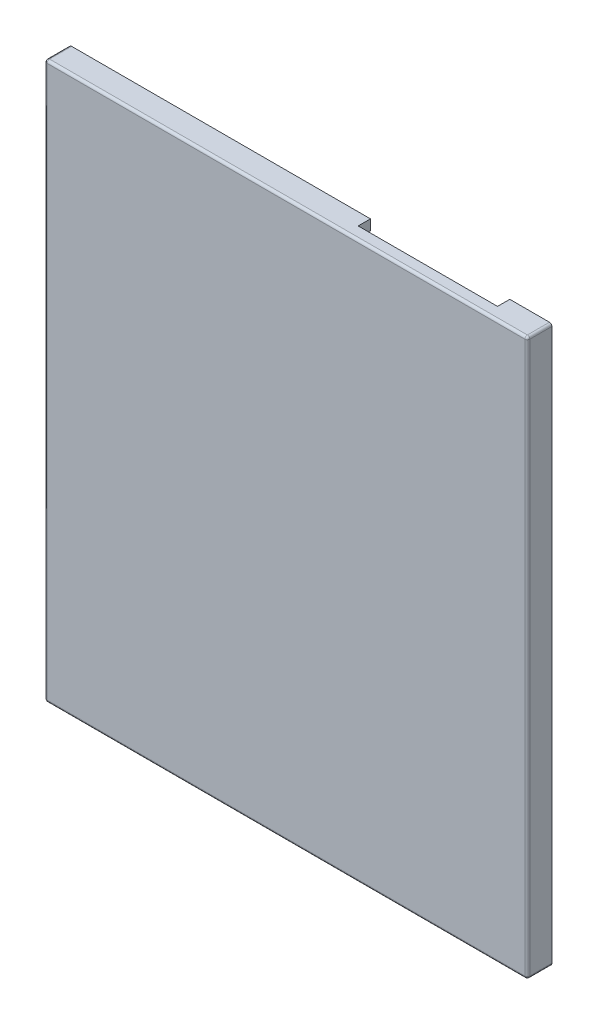
ISO-10303-21;
HEADER;
FILE_DESCRIPTION(('STEP AP214'),'2;1');
FILE_NAME('part.step','',(''),(''),'','','');
FILE_SCHEMA(('AUTOMOTIVE_DESIGN { 1 0 10303 214 1 1 1 1 }'));
ENDSEC;
DATA;
#1=APPLICATION_CONTEXT('core data for automotive mechanical design processes');
#2=APPLICATION_PROTOCOL_DEFINITION('international standard','automotive_design',2000,#1);
#3=PRODUCT_CONTEXT('',#1,'mechanical');
#4=PRODUCT('Part','Part','',(#3));
#5=PRODUCT_RELATED_PRODUCT_CATEGORY('part','',(#4));
#6=PRODUCT_DEFINITION_FORMATION('','',#4);
#7=PRODUCT_DEFINITION_CONTEXT('part definition',#1,'design');
#8=PRODUCT_DEFINITION('design','',#6,#7);
#9=PRODUCT_DEFINITION_SHAPE('','',#8);
#10=(LENGTH_UNIT() NAMED_UNIT(*) SI_UNIT(.MILLI.,.METRE.));
#11=(NAMED_UNIT(*) PLANE_ANGLE_UNIT() SI_UNIT($,.RADIAN.));
#12=(NAMED_UNIT(*) SI_UNIT($,.STERADIAN.) SOLID_ANGLE_UNIT());
#13=UNCERTAINTY_MEASURE_WITH_UNIT(LENGTH_MEASURE(1.E-05),#10,'distance_accuracy_value','');
#14=(GEOMETRIC_REPRESENTATION_CONTEXT(3) GLOBAL_UNCERTAINTY_ASSIGNED_CONTEXT((#13)) GLOBAL_UNIT_ASSIGNED_CONTEXT((#10,
#11,#12)) REPRESENTATION_CONTEXT('',''));
#15=CARTESIAN_POINT('',(0.,0.,0.));
#16=DIRECTION('',(0.,0.,1.));
#17=DIRECTION('',(1.,0.,0.));
#18=AXIS2_PLACEMENT_3D('',#15,#16,#17);
#19=CARTESIAN_POINT('',(-28.25,32.75,-1.5));
#20=DIRECTION('',(0.,1.,0.));
#21=DIRECTION('',(0.,0.,1.));
#22=AXIS2_PLACEMENT_3D('',#19,#20,#21);
#23=PLANE('',#22);
#24=DIRECTION('',(-1.,0.,0.));
#25=VECTOR('',#24,1.);
#26=CARTESIAN_POINT('',(-28.25,32.75,0.));
#27=LINE('',#26,#25);
#28=CARTESIAN_POINT('',(28.25,32.75,0.));
#29=VERTEX_POINT('',#28);
#30=CARTESIAN_POINT('',(24.3537366364064,32.75,0.));
#31=VERTEX_POINT('',#30);
#32=EDGE_CURVE('E254',#29,#31,#27,.T.);
#33=ORIENTED_EDGE('',*,*,#32,.T.);
#34=DIRECTION('',(0.,0.,-1.));
#35=VECTOR('',#34,1.);
#36=CARTESIAN_POINT('',(24.3537366364064,32.75,0.));
#37=LINE('',#36,#35);
#38=CARTESIAN_POINT('',(24.3537366364064,32.75,-1.5));
#39=VERTEX_POINT('',#38);
#40=EDGE_CURVE('E237',#31,#39,#37,.T.);
#41=ORIENTED_EDGE('',*,*,#40,.T.);
#42=DIRECTION('',(-1.,0.,0.));
#43=VECTOR('',#42,1.);
#44=CARTESIAN_POINT('',(-28.25,32.75,-1.5));
#45=LINE('',#44,#43);
#46=CARTESIAN_POINT('',(28.25,32.75,-1.5));
#47=VERTEX_POINT('',#46);
#48=EDGE_CURVE('E395',#47,#39,#45,.T.);
#49=ORIENTED_EDGE('',*,*,#48,.F.);
#50=DIRECTION('',(0.,0.,1.));
#51=VECTOR('',#50,1.);
#52=CARTESIAN_POINT('',(28.25,32.75,-1.5));
#53=LINE('',#52,#51);
#54=EDGE_CURVE('E264',#47,#29,#53,.T.);
#55=ORIENTED_EDGE('',*,*,#54,.T.);
#56=EDGE_LOOP('',(#33,#41,#49,#55));
#57=FACE_BOUND('',#56,.T.);
#58=ADVANCED_FACE('F38',(#57),#23,.F.);
#59=CARTESIAN_POINT('',(0.,0.,0.));
#60=DIRECTION('',(0.,0.,1.));
#61=DIRECTION('',(1.,0.,0.));
#62=AXIS2_PLACEMENT_3D('',#59,#60,#61);
#63=PLANE('',#62);
#64=DIRECTION('',(0.,1.,0.));
#65=VECTOR('',#64,1.);
#66=CARTESIAN_POINT('',(28.25,32.75,0.));
#67=LINE('',#66,#65);
#68=CARTESIAN_POINT('',(28.25,-32.75,0.));
#69=VERTEX_POINT('',#68);
#70=EDGE_CURVE('E274',#69,#29,#67,.T.);
#71=ORIENTED_EDGE('',*,*,#70,.F.);
#72=DIRECTION('',(1.,0.,0.));
#73=VECTOR('',#72,1.);
#74=CARTESIAN_POINT('',(-28.25,-32.75,0.));
#75=LINE('',#74,#73);
#76=CARTESIAN_POINT('',(-28.25,-32.75,0.));
#77=VERTEX_POINT('',#76);
#78=EDGE_CURVE('E272',#77,#69,#75,.T.);
#79=ORIENTED_EDGE('',*,*,#78,.F.);
#80=DIRECTION('',(0.,-1.,0.));
#81=VECTOR('',#80,1.);
#82=CARTESIAN_POINT('',(-28.25,32.75,0.));
#83=LINE('',#82,#81);
#84=CARTESIAN_POINT('',(-28.25,32.75,0.));
#85=VERTEX_POINT('',#84);
#86=EDGE_CURVE('E266',#85,#77,#83,.T.);
#87=ORIENTED_EDGE('',*,*,#86,.F.);
#88=CARTESIAN_POINT('',(7.31866225857841,32.75,0.));
#89=VERTEX_POINT('',#88);
#90=EDGE_CURVE('E267',#89,#85,#27,.T.);
#91=ORIENTED_EDGE('',*,*,#90,.F.);
#92=DIRECTION('',(0.,1.,0.));
#93=VECTOR('',#92,1.);
#94=CARTESIAN_POINT('',(7.31866225857841,32.75,0.));
#95=LINE('',#94,#93);
#96=CARTESIAN_POINT('',(7.31866225857841,34.,0.));
#97=VERTEX_POINT('',#96);
#98=EDGE_CURVE('E260',#89,#97,#95,.T.);
#99=ORIENTED_EDGE('',*,*,#98,.T.);
#100=DIRECTION('',(1.,0.,0.));
#101=VECTOR('',#100,1.);
#102=CARTESIAN_POINT('',(24.3537366364064,34.,0.));
#103=LINE('',#102,#101);
#104=CARTESIAN_POINT('',(24.3537366364064,34.,0.));
#105=VERTEX_POINT('',#104);
#106=EDGE_CURVE('E249',#97,#105,#103,.T.);
#107=ORIENTED_EDGE('',*,*,#106,.T.);
#108=DIRECTION('',(0.,-1.,0.));
#109=VECTOR('',#108,1.);
#110=CARTESIAN_POINT('',(24.3537366364064,32.75,0.));
#111=LINE('',#110,#109);
#112=EDGE_CURVE('E240',#105,#31,#111,.T.);
#113=ORIENTED_EDGE('',*,*,#112,.T.);
#114=ORIENTED_EDGE('',*,*,#32,.F.);
#115=EDGE_LOOP('',(#71,#79,#87,#91,#99,#107,#113,#114));
#116=FACE_BOUND('',#115,.T.);
#117=DIRECTION('',(-1.,0.,0.));
#118=VECTOR('',#117,1.);
#119=CARTESIAN_POINT('',(-1.25,-30.75,0.));
#120=LINE('',#119,#118);
#121=CARTESIAN_POINT('',(-1.25,-30.75,0.));
#122=VERTEX_POINT('',#121);
#123=CARTESIAN_POINT('',(-21.25,-30.75,0.));
#124=VERTEX_POINT('',#123);
#125=EDGE_CURVE('E571',#122,#124,#120,.T.);
#126=ORIENTED_EDGE('',*,*,#125,.F.);
#127=DIRECTION('',(0.,-1.,0.));
#128=VECTOR('',#127,1.);
#129=CARTESIAN_POINT('',(-1.25,-0.750000000000008,0.));
#130=LINE('',#129,#128);
#131=CARTESIAN_POINT('',(-1.25,-0.750000000000008,0.));
#132=VERTEX_POINT('',#131);
#133=EDGE_CURVE('E568',#132,#122,#130,.T.);
#134=ORIENTED_EDGE('',*,*,#133,.F.);
#135=DIRECTION('',(1.,0.,0.));
#136=VECTOR('',#135,1.);
#137=CARTESIAN_POINT('',(-1.25,-0.750000000000008,0.));
#138=LINE('',#137,#136);
#139=CARTESIAN_POINT('',(-21.25,-0.750000000000008,0.));
#140=VERTEX_POINT('',#139);
#141=EDGE_CURVE('E556',#140,#132,#138,.T.);
#142=ORIENTED_EDGE('',*,*,#141,.F.);
#143=DIRECTION('',(0.,1.,0.));
#144=VECTOR('',#143,1.);
#145=CARTESIAN_POINT('',(-21.25,-0.750000000000008,0.));
#146=LINE('',#145,#144);
#147=EDGE_CURVE('E575',#124,#140,#146,.T.);
#148=ORIENTED_EDGE('',*,*,#147,.F.);
#149=EDGE_LOOP('',(#126,#134,#142,#148));
#150=FACE_BOUND('',#149,.T.);
#151=DIRECTION('',(-1.,0.,0.));
#152=VECTOR('',#151,1.);
#153=CARTESIAN_POINT('',(4.75,11.25,0.));
#154=LINE('',#153,#152);
#155=CARTESIAN_POINT('',(4.75,11.25,0.));
#156=VERTEX_POINT('',#155);
#157=CARTESIAN_POINT('',(-20.25,11.25,0.));
#158=VERTEX_POINT('',#157);
#159=EDGE_CURVE('E486',#156,#158,#154,.T.);
#160=ORIENTED_EDGE('',*,*,#159,.F.);
#161=DIRECTION('',(0.,-1.,0.));
#162=VECTOR('',#161,1.);
#163=CARTESIAN_POINT('',(4.75,16.25,0.));
#164=LINE('',#163,#162);
#165=CARTESIAN_POINT('',(4.75,16.25,0.));
#166=VERTEX_POINT('',#165);
#167=EDGE_CURVE('E483',#166,#156,#164,.T.);
#168=ORIENTED_EDGE('',*,*,#167,.F.);
#169=DIRECTION('',(1.,0.,0.));
#170=VECTOR('',#169,1.);
#171=CARTESIAN_POINT('',(4.75,16.25,0.));
#172=LINE('',#171,#170);
#173=CARTESIAN_POINT('',(-20.25,16.25,0.));
#174=VERTEX_POINT('',#173);
#175=EDGE_CURVE('E470',#174,#166,#172,.T.);
#176=ORIENTED_EDGE('',*,*,#175,.F.);
#177=DIRECTION('',(0.,1.,0.));
#178=VECTOR('',#177,1.);
#179=CARTESIAN_POINT('',(-20.25,16.25,0.));
#180=LINE('',#179,#178);
#181=EDGE_CURVE('E491',#158,#174,#180,.T.);
#182=ORIENTED_EDGE('',*,*,#181,.F.);
#183=EDGE_LOOP('',(#160,#168,#176,#182));
#184=FACE_BOUND('',#183,.T.);
#185=DIRECTION('',(0.,-1.,0.));
#186=VECTOR('',#185,1.);
#187=CARTESIAN_POINT('',(9.44938671696299,9.74999999999999,0.));
#188=LINE('',#187,#186);
#189=CARTESIAN_POINT('',(9.44938671696299,9.74999999999999,0.));
#190=VERTEX_POINT('',#189);
#191=CARTESIAN_POINT('',(9.44938671696299,1.24999999999999,0.));
#192=VERTEX_POINT('',#191);
#193=EDGE_CURVE('E527',#190,#192,#188,.T.);
#194=ORIENTED_EDGE('',*,*,#193,.F.);
#195=DIRECTION('',(1.,0.,0.));
#196=VECTOR('',#195,1.);
#197=CARTESIAN_POINT('',(9.44938671696299,9.74999999999999,0.));
#198=LINE('',#197,#196);
#199=CARTESIAN_POINT('',(-21.25,9.74999999999999,0.));
#200=VERTEX_POINT('',#199);
#201=EDGE_CURVE('E514',#200,#190,#198,.T.);
#202=ORIENTED_EDGE('',*,*,#201,.F.);
#203=DIRECTION('',(0.,1.,0.));
#204=VECTOR('',#203,1.);
#205=CARTESIAN_POINT('',(-21.25,9.74999999999999,0.));
#206=LINE('',#205,#204);
#207=CARTESIAN_POINT('',(-21.25,1.24999999999999,0.));
#208=VERTEX_POINT('',#207);
#209=EDGE_CURVE('E64',#208,#200,#206,.T.);
#210=ORIENTED_EDGE('',*,*,#209,.F.);
#211=DIRECTION('',(-1.,0.,0.));
#212=VECTOR('',#211,1.);
#213=CARTESIAN_POINT('',(9.44938671696299,1.24999999999999,0.));
#214=LINE('',#213,#212);
#215=EDGE_CURVE('E531',#192,#208,#214,.T.);
#216=ORIENTED_EDGE('',*,*,#215,.F.);
#217=EDGE_LOOP('',(#194,#202,#210,#216));
#218=FACE_BOUND('',#217,.T.);
#219=ADVANCED_FACE('F252',(#116,#150,#184,#218),#63,.F.);
#220=CARTESIAN_POINT('',(0.,0.,1.5));
#221=DIRECTION('',(0.,0.,1.));
#222=DIRECTION('',(1.,0.,0.));
#223=AXIS2_PLACEMENT_3D('',#220,#221,#222);
#224=PLANE('',#223);
#225=DIRECTION('',(0.,-1.,0.));
#226=VECTOR('',#225,1.);
#227=CARTESIAN_POINT('',(-29.2,0.,1.5));
#228=LINE('',#227,#226);
#229=CARTESIAN_POINT('',(-29.2,33.7,1.5));
#230=VERTEX_POINT('',#229);
#231=CARTESIAN_POINT('',(-29.2,-33.7,1.5));
#232=VERTEX_POINT('',#231);
#233=EDGE_CURVE('E287',#230,#232,#228,.T.);
#234=ORIENTED_EDGE('',*,*,#233,.T.);
#235=DIRECTION('',(1.,0.,0.));
#236=VECTOR('',#235,1.);
#237=CARTESIAN_POINT('',(0.,-33.7,1.5));
#238=LINE('',#237,#236);
#239=CARTESIAN_POINT('',(29.2,-33.7,1.5));
#240=VERTEX_POINT('',#239);
#241=EDGE_CURVE('E290',#232,#240,#238,.T.);
#242=ORIENTED_EDGE('',*,*,#241,.T.);
#243=DIRECTION('',(0.,1.,0.));
#244=VECTOR('',#243,1.);
#245=CARTESIAN_POINT('',(29.2,0.,1.5));
#246=LINE('',#245,#244);
#247=CARTESIAN_POINT('',(29.2,33.7,1.5));
#248=VERTEX_POINT('',#247);
#249=EDGE_CURVE('E281',#240,#248,#246,.T.);
#250=ORIENTED_EDGE('',*,*,#249,.T.);
#251=DIRECTION('',(-1.,0.,0.));
#252=VECTOR('',#251,1.);
#253=CARTESIAN_POINT('',(0.,33.7,1.5));
#254=LINE('',#253,#252);
#255=EDGE_CURVE('E284',#248,#230,#254,.T.);
#256=ORIENTED_EDGE('',*,*,#255,.T.);
#257=EDGE_LOOP('',(#234,#242,#250,#256));
#258=FACE_BOUND('',#257,.T.);
#259=ADVANCED_FACE('F627',(#258),#224,.T.);
#260=CARTESIAN_POINT('',(28.25,32.75,-1.5));
#261=DIRECTION('',(1.,0.,0.));
#262=DIRECTION('',(0.,0.,-1.));
#263=AXIS2_PLACEMENT_3D('',#260,#261,#262);
#264=PLANE('',#263);
#265=DIRECTION('',(0.,0.,1.));
#266=VECTOR('',#265,1.);
#267=CARTESIAN_POINT('',(28.25,-32.75,-1.5));
#268=LINE('',#267,#266);
#269=CARTESIAN_POINT('',(28.25,-32.75,-1.5));
#270=VERTEX_POINT('',#269);
#271=EDGE_CURVE('E409',#270,#69,#268,.T.);
#272=ORIENTED_EDGE('',*,*,#271,.T.);
#273=ORIENTED_EDGE('',*,*,#70,.T.);
#274=ORIENTED_EDGE('',*,*,#54,.F.);
#275=DIRECTION('',(0.,1.,0.));
#276=VECTOR('',#275,1.);
#277=CARTESIAN_POINT('',(28.25,32.75,-1.5));
#278=LINE('',#277,#276);
#279=EDGE_CURVE('E385',#270,#47,#278,.T.);
#280=ORIENTED_EDGE('',*,*,#279,.F.);
#281=EDGE_LOOP('',(#272,#273,#274,#280));
#282=FACE_BOUND('',#281,.T.);
#283=ADVANCED_FACE('F443',(#282),#264,.F.);
#284=CARTESIAN_POINT('',(-28.25,-32.75,-1.5));
#285=DIRECTION('',(0.,-1.,0.));
#286=DIRECTION('',(0.,0.,-1.));
#287=AXIS2_PLACEMENT_3D('',#284,#285,#286);
#288=PLANE('',#287);
#289=DIRECTION('',(0.,0.,1.));
#290=VECTOR('',#289,1.);
#291=CARTESIAN_POINT('',(-28.25,-32.75,-1.5));
#292=LINE('',#291,#290);
#293=CARTESIAN_POINT('',(-28.25,-32.75,-1.5));
#294=VERTEX_POINT('',#293);
#295=EDGE_CURVE('E414',#294,#77,#292,.T.);
#296=ORIENTED_EDGE('',*,*,#295,.T.);
#297=ORIENTED_EDGE('',*,*,#78,.T.);
#298=ORIENTED_EDGE('',*,*,#271,.F.);
#299=DIRECTION('',(1.,0.,0.));
#300=VECTOR('',#299,1.);
#301=CARTESIAN_POINT('',(-28.25,-32.75,-1.5));
#302=LINE('',#301,#300);
#303=EDGE_CURVE('E406',#294,#270,#302,.T.);
#304=ORIENTED_EDGE('',*,*,#303,.F.);
#305=EDGE_LOOP('',(#296,#297,#298,#304));
#306=FACE_BOUND('',#305,.T.);
#307=ADVANCED_FACE('F446',(#306),#288,.F.);
#308=CARTESIAN_POINT('',(-28.25,32.75,-1.5));
#309=DIRECTION('',(-1.,0.,0.));
#310=DIRECTION('',(0.,0.,1.));
#311=AXIS2_PLACEMENT_3D('',#308,#309,#310);
#312=PLANE('',#311);
#313=DIRECTION('',(0.,0.,1.));
#314=VECTOR('',#313,1.);
#315=CARTESIAN_POINT('',(-28.25,32.75,-1.5));
#316=LINE('',#315,#314);
#317=CARTESIAN_POINT('',(-28.25,32.75,-1.5));
#318=VERTEX_POINT('',#317);
#319=EDGE_CURVE('E418',#318,#85,#316,.T.);
#320=ORIENTED_EDGE('',*,*,#319,.T.);
#321=ORIENTED_EDGE('',*,*,#86,.T.);
#322=ORIENTED_EDGE('',*,*,#295,.F.);
#323=DIRECTION('',(0.,-1.,0.));
#324=VECTOR('',#323,1.);
#325=CARTESIAN_POINT('',(-28.25,32.75,-1.5));
#326=LINE('',#325,#324);
#327=EDGE_CURVE('E402',#318,#294,#326,.T.);
#328=ORIENTED_EDGE('',*,*,#327,.F.);
#329=EDGE_LOOP('',(#320,#321,#322,#328));
#330=FACE_BOUND('',#329,.T.);
#331=ADVANCED_FACE('F450',(#330),#312,.F.);
#332=CARTESIAN_POINT('',(7.31866225857841,32.75,-1.5));
#333=VERTEX_POINT('',#332);
#334=EDGE_CURVE('E389',#333,#318,#45,.T.);
#335=ORIENTED_EDGE('',*,*,#334,.F.);
#336=DIRECTION('',(0.,0.,-1.));
#337=VECTOR('',#336,1.);
#338=CARTESIAN_POINT('',(7.31866225857841,32.75,0.));
#339=LINE('',#338,#337);
#340=EDGE_CURVE('E56',#89,#333,#339,.T.);
#341=ORIENTED_EDGE('',*,*,#340,.F.);
#342=ORIENTED_EDGE('',*,*,#90,.T.);
#343=ORIENTED_EDGE('',*,*,#319,.F.);
#344=EDGE_LOOP('',(#335,#341,#342,#343));
#345=FACE_BOUND('',#344,.T.);
#346=ADVANCED_FACE('F455',(#345),#23,.F.);
#347=CARTESIAN_POINT('',(29.5,34.,-1.5));
#348=DIRECTION('',(1.,0.,0.));
#349=DIRECTION('',(0.,1.,0.));
#350=AXIS2_PLACEMENT_3D('',#347,#348,#349);
#351=PLANE('',#350);
#352=DIRECTION('',(0.,1.,0.));
#353=VECTOR('',#352,1.);
#354=CARTESIAN_POINT('',(29.5,34.,1.2));
#355=LINE('',#354,#353);
#356=CARTESIAN_POINT('',(29.5,33.7,1.2));
#357=VERTEX_POINT('',#356);
#358=CARTESIAN_POINT('',(29.5,-33.7,1.2));
#359=VERTEX_POINT('',#358);
#360=EDGE_CURVE('E325',#357,#359,#355,.F.);
#361=ORIENTED_EDGE('',*,*,#360,.T.);
#362=DIRECTION('',(0.,0.,1.));
#363=VECTOR('',#362,1.);
#364=CARTESIAN_POINT('',(29.5,-33.7,-1.5));
#365=LINE('',#364,#363);
#366=CARTESIAN_POINT('',(29.5,-33.7,-1.5));
#367=VERTEX_POINT('',#366);
#368=EDGE_CURVE('E328',#359,#367,#365,.F.);
#369=ORIENTED_EDGE('',*,*,#368,.T.);
#370=DIRECTION('',(0.,1.,0.));
#371=VECTOR('',#370,1.);
#372=CARTESIAN_POINT('',(29.5,34.,-1.5));
#373=LINE('',#372,#371);
#374=CARTESIAN_POINT('',(29.5,33.7,-1.5));
#375=VERTEX_POINT('',#374);
#376=EDGE_CURVE('E413',#367,#375,#373,.T.);
#377=ORIENTED_EDGE('',*,*,#376,.T.);
#378=DIRECTION('',(0.,0.,1.));
#379=VECTOR('',#378,1.);
#380=CARTESIAN_POINT('',(29.5,33.7,-1.5));
#381=LINE('',#380,#379);
#382=EDGE_CURVE('E322',#375,#357,#381,.T.);
#383=ORIENTED_EDGE('',*,*,#382,.T.);
#384=EDGE_LOOP('',(#361,#369,#377,#383));
#385=FACE_BOUND('',#384,.T.);
#386=ADVANCED_FACE('F632',(#385),#351,.T.);
#387=CARTESIAN_POINT('',(-29.5,-34.,-1.5));
#388=DIRECTION('',(0.,-1.,0.));
#389=DIRECTION('',(0.,0.,-1.));
#390=AXIS2_PLACEMENT_3D('',#387,#388,#389);
#391=PLANE('',#390);
#392=DIRECTION('',(1.,0.,0.));
#393=VECTOR('',#392,1.);
#394=CARTESIAN_POINT('',(-29.5,-34.,1.2));
#395=LINE('',#394,#393);
#396=CARTESIAN_POINT('',(29.2,-34.,1.2));
#397=VERTEX_POINT('',#396);
#398=CARTESIAN_POINT('',(-29.2,-34.,1.2));
#399=VERTEX_POINT('',#398);
#400=EDGE_CURVE('E297',#397,#399,#395,.F.);
#401=ORIENTED_EDGE('',*,*,#400,.T.);
#402=DIRECTION('',(0.,0.,1.));
#403=VECTOR('',#402,1.);
#404=CARTESIAN_POINT('',(-29.2,-34.,-1.5));
#405=LINE('',#404,#403);
#406=CARTESIAN_POINT('',(-29.2,-34.,-1.5));
#407=VERTEX_POINT('',#406);
#408=EDGE_CURVE('E301',#399,#407,#405,.F.);
#409=ORIENTED_EDGE('',*,*,#408,.T.);
#410=DIRECTION('',(1.,0.,0.));
#411=VECTOR('',#410,1.);
#412=CARTESIAN_POINT('',(-29.5,-34.,-1.5));
#413=LINE('',#412,#411);
#414=CARTESIAN_POINT('',(29.2,-34.,-1.5));
#415=VERTEX_POINT('',#414);
#416=EDGE_CURVE('E435',#407,#415,#413,.T.);
#417=ORIENTED_EDGE('',*,*,#416,.T.);
#418=DIRECTION('',(0.,0.,1.));
#419=VECTOR('',#418,1.);
#420=CARTESIAN_POINT('',(29.2,-34.,-1.5));
#421=LINE('',#420,#419);
#422=EDGE_CURVE('E294',#415,#397,#421,.T.);
#423=ORIENTED_EDGE('',*,*,#422,.T.);
#424=EDGE_LOOP('',(#401,#409,#417,#423));
#425=FACE_BOUND('',#424,.T.);
#426=ADVANCED_FACE('F637',(#425),#391,.T.);
#427=CARTESIAN_POINT('',(-29.5,34.,-1.5));
#428=DIRECTION('',(-1.,0.,0.));
#429=DIRECTION('',(0.,-1.,0.));
#430=AXIS2_PLACEMENT_3D('',#427,#428,#429);
#431=PLANE('',#430);
#432=DIRECTION('',(0.,-1.,0.));
#433=VECTOR('',#432,1.);
#434=CARTESIAN_POINT('',(-29.5,34.,1.2));
#435=LINE('',#434,#433);
#436=CARTESIAN_POINT('',(-29.5,-33.7,1.2));
#437=VERTEX_POINT('',#436);
#438=CARTESIAN_POINT('',(-29.5,33.7,1.2));
#439=VERTEX_POINT('',#438);
#440=EDGE_CURVE('E307',#437,#439,#435,.F.);
#441=ORIENTED_EDGE('',*,*,#440,.T.);
#442=DIRECTION('',(0.,0.,1.));
#443=VECTOR('',#442,1.);
#444=CARTESIAN_POINT('',(-29.5,33.7,-1.5));
#445=LINE('',#444,#443);
#446=CARTESIAN_POINT('',(-29.5,33.7,-1.5));
#447=VERTEX_POINT('',#446);
#448=EDGE_CURVE('E310',#439,#447,#445,.F.);
#449=ORIENTED_EDGE('',*,*,#448,.T.);
#450=DIRECTION('',(0.,-1.,0.));
#451=VECTOR('',#450,1.);
#452=CARTESIAN_POINT('',(-29.5,34.,-1.5));
#453=LINE('',#452,#451);
#454=CARTESIAN_POINT('',(-29.5,-33.7,-1.5));
#455=VERTEX_POINT('',#454);
#456=EDGE_CURVE('E432',#447,#455,#453,.T.);
#457=ORIENTED_EDGE('',*,*,#456,.T.);
#458=DIRECTION('',(0.,0.,1.));
#459=VECTOR('',#458,1.);
#460=CARTESIAN_POINT('',(-29.5,-33.7,-1.5));
#461=LINE('',#460,#459);
#462=EDGE_CURVE('E304',#455,#437,#461,.T.);
#463=ORIENTED_EDGE('',*,*,#462,.T.);
#464=EDGE_LOOP('',(#441,#449,#457,#463));
#465=FACE_BOUND('',#464,.T.);
#466=ADVANCED_FACE('F658',(#465),#431,.T.);
#467=CARTESIAN_POINT('',(-29.5,34.,-1.5));
#468=DIRECTION('',(0.,1.,0.));
#469=DIRECTION('',(0.,0.,1.));
#470=AXIS2_PLACEMENT_3D('',#467,#468,#469);
#471=PLANE('',#470);
#472=DIRECTION('',(0.,0.,-1.));
#473=VECTOR('',#472,1.);
#474=CARTESIAN_POINT('',(24.3537366364064,34.,0.));
#475=LINE('',#474,#473);
#476=CARTESIAN_POINT('',(24.3537366364064,34.,-1.5));
#477=VERTEX_POINT('',#476);
#478=EDGE_CURVE('E461',#105,#477,#475,.T.);
#479=ORIENTED_EDGE('',*,*,#478,.F.);
#480=ORIENTED_EDGE('',*,*,#106,.F.);
#481=DIRECTION('',(0.,0.,-1.));
#482=VECTOR('',#481,1.);
#483=CARTESIAN_POINT('',(7.31866225857841,34.,0.));
#484=LINE('',#483,#482);
#485=CARTESIAN_POINT('',(7.31866225857841,34.,-1.5));
#486=VERTEX_POINT('',#485);
#487=EDGE_CURVE('E457',#97,#486,#484,.T.);
#488=ORIENTED_EDGE('',*,*,#487,.T.);
#489=DIRECTION('',(-1.,0.,0.));
#490=VECTOR('',#489,1.);
#491=CARTESIAN_POINT('',(-29.5,34.,-1.5));
#492=LINE('',#491,#490);
#493=CARTESIAN_POINT('',(-29.2,34.,-1.5));
#494=VERTEX_POINT('',#493);
#495=EDGE_CURVE('E427',#486,#494,#492,.T.);
#496=ORIENTED_EDGE('',*,*,#495,.T.);
#497=DIRECTION('',(0.,0.,1.));
#498=VECTOR('',#497,1.);
#499=CARTESIAN_POINT('',(-29.2,34.,-1.5));
#500=LINE('',#499,#498);
#501=CARTESIAN_POINT('',(-29.2,34.,1.2));
#502=VERTEX_POINT('',#501);
#503=EDGE_CURVE('E319',#494,#502,#500,.T.);
#504=ORIENTED_EDGE('',*,*,#503,.T.);
#505=DIRECTION('',(-1.,0.,0.));
#506=VECTOR('',#505,1.);
#507=CARTESIAN_POINT('',(-29.5,34.,1.2));
#508=LINE('',#507,#506);
#509=CARTESIAN_POINT('',(29.2,34.,1.2));
#510=VERTEX_POINT('',#509);
#511=EDGE_CURVE('E316',#502,#510,#508,.F.);
#512=ORIENTED_EDGE('',*,*,#511,.T.);
#513=DIRECTION('',(0.,0.,1.));
#514=VECTOR('',#513,1.);
#515=CARTESIAN_POINT('',(29.2,34.,-1.5));
#516=LINE('',#515,#514);
#517=CARTESIAN_POINT('',(29.2,34.,-1.5));
#518=VERTEX_POINT('',#517);
#519=EDGE_CURVE('E313',#510,#518,#516,.F.);
#520=ORIENTED_EDGE('',*,*,#519,.T.);
#521=EDGE_CURVE('E428',#518,#477,#492,.T.);
#522=ORIENTED_EDGE('',*,*,#521,.T.);
#523=EDGE_LOOP('',(#479,#480,#488,#496,#504,#512,#520,#522));
#524=FACE_BOUND('',#523,.T.);
#525=ADVANCED_FACE('F655',(#524),#471,.T.);
#526=CARTESIAN_POINT('',(0.,0.,-1.5));
#527=DIRECTION('',(0.,0.,1.));
#528=DIRECTION('',(1.,0.,0.));
#529=AXIS2_PLACEMENT_3D('',#526,#527,#528);
#530=PLANE('',#529);
#531=ORIENTED_EDGE('',*,*,#48,.T.);
#532=DIRECTION('',(0.,-1.,0.));
#533=VECTOR('',#532,1.);
#534=CARTESIAN_POINT('',(24.3537366364064,32.75,-1.5));
#535=LINE('',#534,#533);
#536=EDGE_CURVE('E243',#477,#39,#535,.T.);
#537=ORIENTED_EDGE('',*,*,#536,.F.);
#538=ORIENTED_EDGE('',*,*,#521,.F.);
#539=CARTESIAN_POINT('',(29.2,33.7,-1.5));
#540=DIRECTION('',(0.,0.,1.));
#541=DIRECTION('',(1.,0.,0.));
#542=AXIS2_PLACEMENT_3D('',#539,#540,#541);
#543=CIRCLE('',#542,0.3);
#544=EDGE_CURVE('E331',#518,#375,#543,.F.);
#545=ORIENTED_EDGE('',*,*,#544,.T.);
#546=ORIENTED_EDGE('',*,*,#376,.F.);
#547=CARTESIAN_POINT('',(29.2,-33.7,-1.5));
#548=DIRECTION('',(0.,0.,1.));
#549=DIRECTION('',(1.,0.,0.));
#550=AXIS2_PLACEMENT_3D('',#547,#548,#549);
#551=CIRCLE('',#550,0.3);
#552=EDGE_CURVE('E334',#367,#415,#551,.F.);
#553=ORIENTED_EDGE('',*,*,#552,.T.);
#554=ORIENTED_EDGE('',*,*,#416,.F.);
#555=CARTESIAN_POINT('',(-29.2,-33.7,-1.5));
#556=DIRECTION('',(0.,0.,1.));
#557=DIRECTION('',(1.,0.,0.));
#558=AXIS2_PLACEMENT_3D('',#555,#556,#557);
#559=CIRCLE('',#558,0.3);
#560=EDGE_CURVE('E48',#407,#455,#559,.F.);
#561=ORIENTED_EDGE('',*,*,#560,.T.);
#562=ORIENTED_EDGE('',*,*,#456,.F.);
#563=CARTESIAN_POINT('',(-29.2,33.7,-1.5));
#564=DIRECTION('',(0.,0.,1.));
#565=DIRECTION('',(1.,0.,0.));
#566=AXIS2_PLACEMENT_3D('',#563,#564,#565);
#567=CIRCLE('',#566,0.3);
#568=EDGE_CURVE('E11',#447,#494,#567,.F.);
#569=ORIENTED_EDGE('',*,*,#568,.T.);
#570=ORIENTED_EDGE('',*,*,#495,.F.);
#571=DIRECTION('',(0.,1.,0.));
#572=VECTOR('',#571,1.);
#573=CARTESIAN_POINT('',(7.31866225857841,32.75,-1.5));
#574=LINE('',#573,#572);
#575=EDGE_CURVE('E261',#333,#486,#574,.T.);
#576=ORIENTED_EDGE('',*,*,#575,.F.);
#577=ORIENTED_EDGE('',*,*,#334,.T.);
#578=ORIENTED_EDGE('',*,*,#327,.T.);
#579=ORIENTED_EDGE('',*,*,#303,.T.);
#580=ORIENTED_EDGE('',*,*,#279,.T.);
#581=EDGE_LOOP('',(#531,#537,#538,#545,#546,#553,#554,#561,#562,#569,#570,#576,#577,#578,#579,#580));
#582=FACE_BOUND('',#581,.T.);
#583=ADVANCED_FACE('F652',(#582),#530,.F.);
#584=CARTESIAN_POINT('',(-29.2,33.7,-1.5));
#585=DIRECTION('',(0.,0.,1.));
#586=DIRECTION('',(1.,0.,0.));
#587=AXIS2_PLACEMENT_3D('',#584,#585,#586);
#588=CYLINDRICAL_SURFACE('',#587,0.3);
#589=ORIENTED_EDGE('',*,*,#568,.F.);
#590=ORIENTED_EDGE('',*,*,#448,.F.);
#591=CARTESIAN_POINT('',(-29.2,33.7,1.2));
#592=DIRECTION('',(0.,0.,1.));
#593=DIRECTION('',(1.,0.,0.));
#594=AXIS2_PLACEMENT_3D('',#591,#592,#593);
#595=CIRCLE('',#594,0.3);
#596=EDGE_CURVE('E42',#502,#439,#595,.T.);
#597=ORIENTED_EDGE('',*,*,#596,.F.);
#598=ORIENTED_EDGE('',*,*,#503,.F.);
#599=EDGE_LOOP('',(#589,#590,#597,#598));
#600=FACE_BOUND('',#599,.T.);
#601=ADVANCED_FACE('F40',(#600),#588,.T.);
#602=CARTESIAN_POINT('',(0.,33.7,1.2));
#603=DIRECTION('',(-1.,0.,0.));
#604=DIRECTION('',(0.,0.,1.));
#605=AXIS2_PLACEMENT_3D('',#602,#603,#604);
#606=CYLINDRICAL_SURFACE('',#605,0.3);
#607=CARTESIAN_POINT('',(29.2,33.7,1.2));
#608=DIRECTION('',(1.,0.,0.));
#609=DIRECTION('',(0.,0.,-1.));
#610=AXIS2_PLACEMENT_3D('',#607,#608,#609);
#611=CIRCLE('',#610,0.3);
#612=EDGE_CURVE('E374',#510,#248,#611,.T.);
#613=ORIENTED_EDGE('',*,*,#612,.F.);
#614=ORIENTED_EDGE('',*,*,#511,.F.);
#615=CARTESIAN_POINT('',(-29.2,33.7,1.2));
#616=DIRECTION('',(-1.,0.,0.));
#617=DIRECTION('',(0.,0.,1.));
#618=AXIS2_PLACEMENT_3D('',#615,#616,#617);
#619=CIRCLE('',#618,0.3);
#620=EDGE_CURVE('E377',#230,#502,#619,.T.);
#621=ORIENTED_EDGE('',*,*,#620,.F.);
#622=ORIENTED_EDGE('',*,*,#255,.F.);
#623=EDGE_LOOP('',(#613,#614,#621,#622));
#624=FACE_BOUND('',#623,.T.);
#625=ADVANCED_FACE('F697',(#624),#606,.T.);
#626=CARTESIAN_POINT('',(29.2,33.7,-1.5));
#627=DIRECTION('',(0.,0.,1.));
#628=DIRECTION('',(1.,0.,0.));
#629=AXIS2_PLACEMENT_3D('',#626,#627,#628);
#630=CYLINDRICAL_SURFACE('',#629,0.3);
#631=ORIENTED_EDGE('',*,*,#544,.F.);
#632=ORIENTED_EDGE('',*,*,#519,.F.);
#633=CARTESIAN_POINT('',(29.2,33.7,1.2));
#634=DIRECTION('',(0.,0.,1.));
#635=DIRECTION('',(1.,0.,0.));
#636=AXIS2_PLACEMENT_3D('',#633,#634,#635);
#637=CIRCLE('',#636,0.3);
#638=EDGE_CURVE('E370',#357,#510,#637,.T.);
#639=ORIENTED_EDGE('',*,*,#638,.F.);
#640=ORIENTED_EDGE('',*,*,#382,.F.);
#641=EDGE_LOOP('',(#631,#632,#639,#640));
#642=FACE_BOUND('',#641,.T.);
#643=ADVANCED_FACE('F695',(#642),#630,.T.);
#644=CARTESIAN_POINT('',(-29.2,33.7,1.2));
#645=DIRECTION('',(0.,0.,1.));
#646=DIRECTION('',(1.,0.,0.));
#647=AXIS2_PLACEMENT_3D('',#644,#645,#646);
#648=SPHERICAL_SURFACE('',#647,0.3);
#649=ORIENTED_EDGE('',*,*,#620,.T.);
#650=ORIENTED_EDGE('',*,*,#596,.T.);
#651=CARTESIAN_POINT('',(-29.2,33.7,1.2));
#652=DIRECTION('',(0.,1.,0.));
#653=DIRECTION('',(0.,0.,1.));
#654=AXIS2_PLACEMENT_3D('',#651,#652,#653);
#655=CIRCLE('',#654,0.3);
#656=EDGE_CURVE('E366',#230,#439,#655,.F.);
#657=ORIENTED_EDGE('',*,*,#656,.F.);
#658=EDGE_LOOP('',(#649,#650,#657));
#659=FACE_BOUND('',#658,.T.);
#660=ADVANCED_FACE('F691',(#659),#648,.T.);
#661=CARTESIAN_POINT('',(29.2,33.7,1.2));
#662=DIRECTION('',(0.,0.,1.));
#663=DIRECTION('',(1.,0.,0.));
#664=AXIS2_PLACEMENT_3D('',#661,#662,#663);
#665=SPHERICAL_SURFACE('',#664,0.3);
#666=ORIENTED_EDGE('',*,*,#638,.T.);
#667=ORIENTED_EDGE('',*,*,#612,.T.);
#668=CARTESIAN_POINT('',(29.2,33.7,1.2));
#669=DIRECTION('',(0.,1.,0.));
#670=DIRECTION('',(0.,0.,1.));
#671=AXIS2_PLACEMENT_3D('',#668,#669,#670);
#672=CIRCLE('',#671,0.3);
#673=EDGE_CURVE('E362',#357,#248,#672,.F.);
#674=ORIENTED_EDGE('',*,*,#673,.F.);
#675=EDGE_LOOP('',(#666,#667,#674));
#676=FACE_BOUND('',#675,.T.);
#677=ADVANCED_FACE('F687',(#676),#665,.T.);
#678=CARTESIAN_POINT('',(-29.2,-33.7,-1.5));
#679=DIRECTION('',(0.,0.,1.));
#680=DIRECTION('',(1.,0.,0.));
#681=AXIS2_PLACEMENT_3D('',#678,#679,#680);
#682=CYLINDRICAL_SURFACE('',#681,0.3);
#683=ORIENTED_EDGE('',*,*,#560,.F.);
#684=ORIENTED_EDGE('',*,*,#408,.F.);
#685=CARTESIAN_POINT('',(-29.2,-33.7,1.2));
#686=DIRECTION('',(0.,0.,1.));
#687=DIRECTION('',(1.,0.,0.));
#688=AXIS2_PLACEMENT_3D('',#685,#686,#687);
#689=CIRCLE('',#688,0.3);
#690=EDGE_CURVE('E358',#437,#399,#689,.T.);
#691=ORIENTED_EDGE('',*,*,#690,.F.);
#692=ORIENTED_EDGE('',*,*,#462,.F.);
#693=EDGE_LOOP('',(#683,#684,#691,#692));
#694=FACE_BOUND('',#693,.T.);
#695=ADVANCED_FACE('F683',(#694),#682,.T.);
#696=CARTESIAN_POINT('',(-29.2,0.,1.2));
#697=DIRECTION('',(0.,-1.,0.));
#698=DIRECTION('',(1.,0.,0.));
#699=AXIS2_PLACEMENT_3D('',#696,#697,#698);
#700=CYLINDRICAL_SURFACE('',#699,0.3);
#701=ORIENTED_EDGE('',*,*,#656,.T.);
#702=ORIENTED_EDGE('',*,*,#440,.F.);
#703=CARTESIAN_POINT('',(-29.2,-33.7,1.2));
#704=DIRECTION('',(0.,-1.,0.));
#705=DIRECTION('',(1.,0.,0.));
#706=AXIS2_PLACEMENT_3D('',#703,#704,#705);
#707=CIRCLE('',#706,0.3);
#708=EDGE_CURVE('E354',#232,#437,#707,.T.);
#709=ORIENTED_EDGE('',*,*,#708,.F.);
#710=ORIENTED_EDGE('',*,*,#233,.F.);
#711=EDGE_LOOP('',(#701,#702,#709,#710));
#712=FACE_BOUND('',#711,.T.);
#713=ADVANCED_FACE('F679',(#712),#700,.T.);
#714=CARTESIAN_POINT('',(29.2,0.,1.2));
#715=DIRECTION('',(0.,1.,0.));
#716=DIRECTION('',(-1.,0.,0.));
#717=AXIS2_PLACEMENT_3D('',#714,#715,#716);
#718=CYLINDRICAL_SURFACE('',#717,0.3);
#719=ORIENTED_EDGE('',*,*,#673,.T.);
#720=ORIENTED_EDGE('',*,*,#249,.F.);
#721=CARTESIAN_POINT('',(29.2,-33.7,1.2));
#722=DIRECTION('',(0.,-1.,0.));
#723=DIRECTION('',(0.,0.,-1.));
#724=AXIS2_PLACEMENT_3D('',#721,#722,#723);
#725=CIRCLE('',#724,0.3);
#726=EDGE_CURVE('E350',#359,#240,#725,.T.);
#727=ORIENTED_EDGE('',*,*,#726,.F.);
#728=ORIENTED_EDGE('',*,*,#360,.F.);
#729=EDGE_LOOP('',(#719,#720,#727,#728));
#730=FACE_BOUND('',#729,.T.);
#731=ADVANCED_FACE('F675',(#730),#718,.T.);
#732=CARTESIAN_POINT('',(29.2,-33.7,-1.5));
#733=DIRECTION('',(0.,0.,1.));
#734=DIRECTION('',(1.,0.,0.));
#735=AXIS2_PLACEMENT_3D('',#732,#733,#734);
#736=CYLINDRICAL_SURFACE('',#735,0.3);
#737=ORIENTED_EDGE('',*,*,#552,.F.);
#738=ORIENTED_EDGE('',*,*,#368,.F.);
#739=CARTESIAN_POINT('',(29.2,-33.7,1.2));
#740=DIRECTION('',(0.,0.,1.));
#741=DIRECTION('',(1.,0.,0.));
#742=AXIS2_PLACEMENT_3D('',#739,#740,#741);
#743=CIRCLE('',#742,0.3);
#744=EDGE_CURVE('E346',#397,#359,#743,.T.);
#745=ORIENTED_EDGE('',*,*,#744,.F.);
#746=ORIENTED_EDGE('',*,*,#422,.F.);
#747=EDGE_LOOP('',(#737,#738,#745,#746));
#748=FACE_BOUND('',#747,.T.);
#749=ADVANCED_FACE('F671',(#748),#736,.T.);
#750=CARTESIAN_POINT('',(-29.2,-33.7,1.2));
#751=DIRECTION('',(0.,0.,1.));
#752=DIRECTION('',(1.,0.,0.));
#753=AXIS2_PLACEMENT_3D('',#750,#751,#752);
#754=SPHERICAL_SURFACE('',#753,0.3);
#755=ORIENTED_EDGE('',*,*,#708,.T.);
#756=ORIENTED_EDGE('',*,*,#690,.T.);
#757=CARTESIAN_POINT('',(-29.2,-33.7,1.2));
#758=DIRECTION('',(-1.,0.,0.));
#759=DIRECTION('',(0.,0.,1.));
#760=AXIS2_PLACEMENT_3D('',#757,#758,#759);
#761=CIRCLE('',#760,0.3);
#762=EDGE_CURVE('E342',#232,#399,#761,.F.);
#763=ORIENTED_EDGE('',*,*,#762,.F.);
#764=EDGE_LOOP('',(#755,#756,#763));
#765=FACE_BOUND('',#764,.T.);
#766=ADVANCED_FACE('F667',(#765),#754,.T.);
#767=CARTESIAN_POINT('',(29.2,-33.7,1.2));
#768=DIRECTION('',(0.,0.,1.));
#769=DIRECTION('',(1.,0.,0.));
#770=AXIS2_PLACEMENT_3D('',#767,#768,#769);
#771=SPHERICAL_SURFACE('',#770,0.3);
#772=ORIENTED_EDGE('',*,*,#744,.T.);
#773=ORIENTED_EDGE('',*,*,#726,.T.);
#774=CARTESIAN_POINT('',(29.2,-33.7,1.2));
#775=DIRECTION('',(1.,0.,0.));
#776=DIRECTION('',(0.,1.,0.));
#777=AXIS2_PLACEMENT_3D('',#774,#775,#776);
#778=CIRCLE('',#777,0.3);
#779=EDGE_CURVE('E339',#397,#240,#778,.F.);
#780=ORIENTED_EDGE('',*,*,#779,.F.);
#781=EDGE_LOOP('',(#772,#773,#780));
#782=FACE_BOUND('',#781,.T.);
#783=ADVANCED_FACE('F617',(#782),#771,.T.);
#784=CARTESIAN_POINT('',(0.,-33.7,1.2));
#785=DIRECTION('',(1.,0.,0.));
#786=DIRECTION('',(0.,0.,-1.));
#787=AXIS2_PLACEMENT_3D('',#784,#785,#786);
#788=CYLINDRICAL_SURFACE('',#787,0.3);
#789=ORIENTED_EDGE('',*,*,#762,.T.);
#790=ORIENTED_EDGE('',*,*,#400,.F.);
#791=ORIENTED_EDGE('',*,*,#779,.T.);
#792=ORIENTED_EDGE('',*,*,#241,.F.);
#793=EDGE_LOOP('',(#789,#790,#791,#792));
#794=FACE_BOUND('',#793,.T.);
#795=ADVANCED_FACE('F610',(#794),#788,.T.);
#796=CARTESIAN_POINT('',(-1.25,-0.750000000000008,1.));
#797=DIRECTION('',(1.,0.,0.));
#798=DIRECTION('',(0.,1.,0.));
#799=AXIS2_PLACEMENT_3D('',#796,#797,#798);
#800=PLANE('',#799);
#801=ORIENTED_EDGE('',*,*,#133,.T.);
#802=DIRECTION('',(0.,0.,-1.));
#803=VECTOR('',#802,1.);
#804=CARTESIAN_POINT('',(-1.25,-30.75,1.));
#805=LINE('',#804,#803);
#806=CARTESIAN_POINT('',(-1.25,-30.75,1.));
#807=VERTEX_POINT('',#806);
#808=EDGE_CURVE('E398',#807,#122,#805,.T.);
#809=ORIENTED_EDGE('',*,*,#808,.F.);
#810=DIRECTION('',(0.,-1.,0.));
#811=VECTOR('',#810,1.);
#812=CARTESIAN_POINT('',(-1.25,-0.750000000000008,1.));
#813=LINE('',#812,#811);
#814=CARTESIAN_POINT('',(-1.25,-0.750000000000008,1.));
#815=VERTEX_POINT('',#814);
#816=EDGE_CURVE('E551',#815,#807,#813,.T.);
#817=ORIENTED_EDGE('',*,*,#816,.F.);
#818=DIRECTION('',(0.,0.,-1.));
#819=VECTOR('',#818,1.);
#820=CARTESIAN_POINT('',(-1.25,-0.750000000000008,1.));
#821=LINE('',#820,#819);
#822=EDGE_CURVE('E532',#815,#132,#821,.T.);
#823=ORIENTED_EDGE('',*,*,#822,.T.);
#824=EDGE_LOOP('',(#801,#809,#817,#823));
#825=FACE_BOUND('',#824,.T.);
#826=ADVANCED_FACE('F608',(#825),#800,.F.);
#827=CARTESIAN_POINT('',(-1.25,-0.750000000000008,1.));
#828=DIRECTION('',(0.,1.,0.));
#829=DIRECTION('',(0.,0.,1.));
#830=AXIS2_PLACEMENT_3D('',#827,#828,#829);
#831=PLANE('',#830);
#832=ORIENTED_EDGE('',*,*,#141,.T.);
#833=ORIENTED_EDGE('',*,*,#822,.F.);
#834=DIRECTION('',(1.,0.,0.));
#835=VECTOR('',#834,1.);
#836=CARTESIAN_POINT('',(-1.25,-0.750000000000008,1.));
#837=LINE('',#836,#835);
#838=CARTESIAN_POINT('',(-21.25,-0.750000000000008,1.));
#839=VERTEX_POINT('',#838);
#840=EDGE_CURVE('E564',#839,#815,#837,.T.);
#841=ORIENTED_EDGE('',*,*,#840,.F.);
#842=DIRECTION('',(0.,0.,-1.));
#843=VECTOR('',#842,1.);
#844=CARTESIAN_POINT('',(-21.25,-0.750000000000008,1.));
#845=LINE('',#844,#843);
#846=EDGE_CURVE('E584',#839,#140,#845,.T.);
#847=ORIENTED_EDGE('',*,*,#846,.T.);
#848=EDGE_LOOP('',(#832,#833,#841,#847));
#849=FACE_BOUND('',#848,.T.);
#850=ADVANCED_FACE('F607',(#849),#831,.F.);
#851=CARTESIAN_POINT('',(-21.25,-0.750000000000008,1.));
#852=DIRECTION('',(-1.,0.,0.));
#853=DIRECTION('',(0.,-1.,0.));
#854=AXIS2_PLACEMENT_3D('',#851,#852,#853);
#855=PLANE('',#854);
#856=ORIENTED_EDGE('',*,*,#147,.T.);
#857=ORIENTED_EDGE('',*,*,#846,.F.);
#858=DIRECTION('',(0.,1.,0.));
#859=VECTOR('',#858,1.);
#860=CARTESIAN_POINT('',(-21.25,-0.750000000000008,1.));
#861=LINE('',#860,#859);
#862=CARTESIAN_POINT('',(-21.25,-30.75,1.));
#863=VERTEX_POINT('',#862);
#864=EDGE_CURVE('E560',#863,#839,#861,.T.);
#865=ORIENTED_EDGE('',*,*,#864,.F.);
#866=DIRECTION('',(0.,0.,-1.));
#867=VECTOR('',#866,1.);
#868=CARTESIAN_POINT('',(-21.25,-30.75,1.));
#869=LINE('',#868,#867);
#870=EDGE_CURVE('E586',#863,#124,#869,.T.);
#871=ORIENTED_EDGE('',*,*,#870,.T.);
#872=EDGE_LOOP('',(#856,#857,#865,#871));
#873=FACE_BOUND('',#872,.T.);
#874=ADVANCED_FACE('F602',(#873),#855,.F.);
#875=CARTESIAN_POINT('',(-1.25,-30.75,1.));
#876=DIRECTION('',(0.,-1.,0.));
#877=DIRECTION('',(0.,0.,-1.));
#878=AXIS2_PLACEMENT_3D('',#875,#876,#877);
#879=PLANE('',#878);
#880=ORIENTED_EDGE('',*,*,#125,.T.);
#881=ORIENTED_EDGE('',*,*,#870,.F.);
#882=DIRECTION('',(-1.,0.,0.));
#883=VECTOR('',#882,1.);
#884=CARTESIAN_POINT('',(-1.25,-30.75,1.));
#885=LINE('',#884,#883);
#886=EDGE_CURVE('E555',#807,#863,#885,.T.);
#887=ORIENTED_EDGE('',*,*,#886,.F.);
#888=ORIENTED_EDGE('',*,*,#808,.T.);
#889=EDGE_LOOP('',(#880,#881,#887,#888));
#890=FACE_BOUND('',#889,.T.);
#891=ADVANCED_FACE('F595',(#890),#879,.F.);
#892=CARTESIAN_POINT('',(0.,0.,1.));
#893=DIRECTION('',(0.,0.,-1.));
#894=DIRECTION('',(-1.,0.,0.));
#895=AXIS2_PLACEMENT_3D('',#892,#893,#894);
#896=PLANE('',#895);
#897=ORIENTED_EDGE('',*,*,#816,.T.);
#898=ORIENTED_EDGE('',*,*,#886,.T.);
#899=ORIENTED_EDGE('',*,*,#864,.T.);
#900=ORIENTED_EDGE('',*,*,#840,.T.);
#901=EDGE_LOOP('',(#897,#898,#899,#900));
#902=FACE_BOUND('',#901,.T.);
#903=ADVANCED_FACE('F606',(#902),#896,.T.);
#904=CARTESIAN_POINT('',(4.75,16.25,1.));
#905=DIRECTION('',(1.,0.,0.));
#906=DIRECTION('',(0.,1.,0.));
#907=AXIS2_PLACEMENT_3D('',#904,#905,#906);
#908=PLANE('',#907);
#909=ORIENTED_EDGE('',*,*,#167,.T.);
#910=DIRECTION('',(0.,0.,-1.));
#911=VECTOR('',#910,1.);
#912=CARTESIAN_POINT('',(4.75,11.25,1.));
#913=LINE('',#912,#911);
#914=CARTESIAN_POINT('',(4.75,11.25,1.));
#915=VERTEX_POINT('',#914);
#916=EDGE_CURVE('E482',#915,#156,#913,.T.);
#917=ORIENTED_EDGE('',*,*,#916,.F.);
#918=DIRECTION('',(0.,-1.,0.));
#919=VECTOR('',#918,1.);
#920=CARTESIAN_POINT('',(4.75,16.25,1.));
#921=LINE('',#920,#919);
#922=CARTESIAN_POINT('',(4.75,16.25,1.));
#923=VERTEX_POINT('',#922);
#924=EDGE_CURVE('E465',#923,#915,#921,.T.);
#925=ORIENTED_EDGE('',*,*,#924,.F.);
#926=DIRECTION('',(0.,0.,-1.));
#927=VECTOR('',#926,1.);
#928=CARTESIAN_POINT('',(4.75,16.25,1.));
#929=LINE('',#928,#927);
#930=EDGE_CURVE('E343',#923,#166,#929,.T.);
#931=ORIENTED_EDGE('',*,*,#930,.T.);
#932=EDGE_LOOP('',(#909,#917,#925,#931));
#933=FACE_BOUND('',#932,.T.);
#934=ADVANCED_FACE('F766',(#933),#908,.F.);
#935=CARTESIAN_POINT('',(4.75,16.25,1.));
#936=DIRECTION('',(0.,1.,0.));
#937=DIRECTION('',(-1.,0.,0.));
#938=AXIS2_PLACEMENT_3D('',#935,#936,#937);
#939=PLANE('',#938);
#940=ORIENTED_EDGE('',*,*,#175,.T.);
#941=ORIENTED_EDGE('',*,*,#930,.F.);
#942=DIRECTION('',(1.,0.,0.));
#943=VECTOR('',#942,1.);
#944=CARTESIAN_POINT('',(4.75,16.25,1.));
#945=LINE('',#944,#943);
#946=CARTESIAN_POINT('',(-20.25,16.25,1.));
#947=VERTEX_POINT('',#946);
#948=EDGE_CURVE('E478',#947,#923,#945,.T.);
#949=ORIENTED_EDGE('',*,*,#948,.F.);
#950=DIRECTION('',(0.,0.,-1.));
#951=VECTOR('',#950,1.);
#952=CARTESIAN_POINT('',(-20.25,16.25,1.));
#953=LINE('',#952,#951);
#954=EDGE_CURVE('E500',#947,#174,#953,.T.);
#955=ORIENTED_EDGE('',*,*,#954,.T.);
#956=EDGE_LOOP('',(#940,#941,#949,#955));
#957=FACE_BOUND('',#956,.T.);
#958=ADVANCED_FACE('F762',(#957),#939,.F.);
#959=CARTESIAN_POINT('',(-20.25,16.25,1.));
#960=DIRECTION('',(-1.,0.,0.));
#961=DIRECTION('',(0.,0.,1.));
#962=AXIS2_PLACEMENT_3D('',#959,#960,#961);
#963=PLANE('',#962);
#964=ORIENTED_EDGE('',*,*,#181,.T.);
#965=ORIENTED_EDGE('',*,*,#954,.F.);
#966=DIRECTION('',(0.,1.,0.));
#967=VECTOR('',#966,1.);
#968=CARTESIAN_POINT('',(-20.25,16.25,1.));
#969=LINE('',#968,#967);
#970=CARTESIAN_POINT('',(-20.25,11.25,1.));
#971=VERTEX_POINT('',#970);
#972=EDGE_CURVE('E474',#971,#947,#969,.T.);
#973=ORIENTED_EDGE('',*,*,#972,.F.);
#974=DIRECTION('',(0.,0.,-1.));
#975=VECTOR('',#974,1.);
#976=CARTESIAN_POINT('',(-20.25,11.25,1.));
#977=LINE('',#976,#975);
#978=EDGE_CURVE('E503',#971,#158,#977,.T.);
#979=ORIENTED_EDGE('',*,*,#978,.T.);
#980=EDGE_LOOP('',(#964,#965,#973,#979));
#981=FACE_BOUND('',#980,.T.);
#982=ADVANCED_FACE('F765',(#981),#963,.F.);
#983=CARTESIAN_POINT('',(4.75,11.25,1.));
#984=DIRECTION('',(0.,-1.,0.));
#985=DIRECTION('',(0.,0.,-1.));
#986=AXIS2_PLACEMENT_3D('',#983,#984,#985);
#987=PLANE('',#986);
#988=ORIENTED_EDGE('',*,*,#159,.T.);
#989=ORIENTED_EDGE('',*,*,#978,.F.);
#990=DIRECTION('',(-1.,0.,0.));
#991=VECTOR('',#990,1.);
#992=CARTESIAN_POINT('',(4.75,11.25,1.));
#993=LINE('',#992,#991);
#994=EDGE_CURVE('E469',#915,#971,#993,.T.);
#995=ORIENTED_EDGE('',*,*,#994,.F.);
#996=ORIENTED_EDGE('',*,*,#916,.T.);
#997=EDGE_LOOP('',(#988,#989,#995,#996));
#998=FACE_BOUND('',#997,.T.);
#999=ADVANCED_FACE('F760',(#998),#987,.F.);
#1000=CARTESIAN_POINT('',(0.,0.,1.));
#1001=DIRECTION('',(0.,0.,-1.));
#1002=DIRECTION('',(-1.,0.,0.));
#1003=AXIS2_PLACEMENT_3D('',#1000,#1001,#1002);
#1004=PLANE('',#1003);
#1005=ORIENTED_EDGE('',*,*,#924,.T.);
#1006=ORIENTED_EDGE('',*,*,#994,.T.);
#1007=ORIENTED_EDGE('',*,*,#972,.T.);
#1008=ORIENTED_EDGE('',*,*,#948,.T.);
#1009=EDGE_LOOP('',(#1005,#1006,#1007,#1008));
#1010=FACE_BOUND('',#1009,.T.);
#1011=ADVANCED_FACE('F756',(#1010),#1004,.T.);
#1012=CARTESIAN_POINT('',(9.44938671696299,9.74999999999999,1.));
#1013=DIRECTION('',(1.,0.,0.));
#1014=DIRECTION('',(0.,1.,0.));
#1015=AXIS2_PLACEMENT_3D('',#1012,#1013,#1014);
#1016=PLANE('',#1015);
#1017=ORIENTED_EDGE('',*,*,#193,.T.);
#1018=DIRECTION('',(0.,0.,-1.));
#1019=VECTOR('',#1018,1.);
#1020=CARTESIAN_POINT('',(9.44938671696299,1.24999999999999,1.));
#1021=LINE('',#1020,#1019);
#1022=CARTESIAN_POINT('',(9.44938671696299,1.24999999999999,1.));
#1023=VERTEX_POINT('',#1022);
#1024=EDGE_CURVE('E526',#1023,#192,#1021,.T.);
#1025=ORIENTED_EDGE('',*,*,#1024,.F.);
#1026=DIRECTION('',(0.,-1.,0.));
#1027=VECTOR('',#1026,1.);
#1028=CARTESIAN_POINT('',(9.44938671696299,9.74999999999999,1.));
#1029=LINE('',#1028,#1027);
#1030=CARTESIAN_POINT('',(9.44938671696299,9.74999999999999,1.));
#1031=VERTEX_POINT('',#1030);
#1032=EDGE_CURVE('E509',#1031,#1023,#1029,.T.);
#1033=ORIENTED_EDGE('',*,*,#1032,.F.);
#1034=DIRECTION('',(0.,0.,-1.));
#1035=VECTOR('',#1034,1.);
#1036=CARTESIAN_POINT('',(9.44938671696299,9.74999999999999,1.));
#1037=LINE('',#1036,#1035);
#1038=EDGE_CURVE('E487',#1031,#190,#1037,.T.);
#1039=ORIENTED_EDGE('',*,*,#1038,.T.);
#1040=EDGE_LOOP('',(#1017,#1025,#1033,#1039));
#1041=FACE_BOUND('',#1040,.T.);
#1042=ADVANCED_FACE('F759',(#1041),#1016,.F.);
#1043=CARTESIAN_POINT('',(9.44938671696299,9.74999999999999,1.));
#1044=DIRECTION('',(0.,1.,0.));
#1045=DIRECTION('',(0.,0.,1.));
#1046=AXIS2_PLACEMENT_3D('',#1043,#1044,#1045);
#1047=PLANE('',#1046);
#1048=ORIENTED_EDGE('',*,*,#201,.T.);
#1049=ORIENTED_EDGE('',*,*,#1038,.F.);
#1050=DIRECTION('',(1.,0.,0.));
#1051=VECTOR('',#1050,1.);
#1052=CARTESIAN_POINT('',(9.44938671696299,9.74999999999999,1.));
#1053=LINE('',#1052,#1051);
#1054=CARTESIAN_POINT('',(-21.25,9.74999999999999,1.));
#1055=VERTEX_POINT('',#1054);
#1056=EDGE_CURVE('E522',#1055,#1031,#1053,.T.);
#1057=ORIENTED_EDGE('',*,*,#1056,.F.);
#1058=DIRECTION('',(0.,0.,-1.));
#1059=VECTOR('',#1058,1.);
#1060=CARTESIAN_POINT('',(-21.25,9.74999999999999,1.));
#1061=LINE('',#1060,#1059);
#1062=EDGE_CURVE('E543',#1055,#200,#1061,.T.);
#1063=ORIENTED_EDGE('',*,*,#1062,.T.);
#1064=EDGE_LOOP('',(#1048,#1049,#1057,#1063));
#1065=FACE_BOUND('',#1064,.T.);
#1066=ADVANCED_FACE('F781',(#1065),#1047,.F.);
#1067=CARTESIAN_POINT('',(-21.25,9.74999999999999,1.));
#1068=DIRECTION('',(-1.,0.,0.));
#1069=DIRECTION('',(0.,-1.,0.));
#1070=AXIS2_PLACEMENT_3D('',#1067,#1068,#1069);
#1071=PLANE('',#1070);
#1072=ORIENTED_EDGE('',*,*,#209,.T.);
#1073=ORIENTED_EDGE('',*,*,#1062,.F.);
#1074=DIRECTION('',(0.,1.,0.));
#1075=VECTOR('',#1074,1.);
#1076=CARTESIAN_POINT('',(-21.25,9.74999999999999,1.));
#1077=LINE('',#1076,#1075);
#1078=CARTESIAN_POINT('',(-21.25,1.24999999999999,1.));
#1079=VERTEX_POINT('',#1078);
#1080=EDGE_CURVE('E518',#1079,#1055,#1077,.T.);
#1081=ORIENTED_EDGE('',*,*,#1080,.F.);
#1082=DIRECTION('',(0.,0.,-1.));
#1083=VECTOR('',#1082,1.);
#1084=CARTESIAN_POINT('',(-21.25,1.24999999999999,1.));
#1085=LINE('',#1084,#1083);
#1086=EDGE_CURVE('E546',#1079,#208,#1085,.T.);
#1087=ORIENTED_EDGE('',*,*,#1086,.T.);
#1088=EDGE_LOOP('',(#1072,#1073,#1081,#1087));
#1089=FACE_BOUND('',#1088,.T.);
#1090=ADVANCED_FACE('F784',(#1089),#1071,.F.);
#1091=CARTESIAN_POINT('',(9.44938671696299,1.24999999999999,1.));
#1092=DIRECTION('',(0.,-1.,0.));
#1093=DIRECTION('',(0.,0.,-1.));
#1094=AXIS2_PLACEMENT_3D('',#1091,#1092,#1093);
#1095=PLANE('',#1094);
#1096=ORIENTED_EDGE('',*,*,#215,.T.);
#1097=ORIENTED_EDGE('',*,*,#1086,.F.);
#1098=DIRECTION('',(-1.,0.,0.));
#1099=VECTOR('',#1098,1.);
#1100=CARTESIAN_POINT('',(9.44938671696299,1.24999999999999,1.));
#1101=LINE('',#1100,#1099);
#1102=EDGE_CURVE('E513',#1023,#1079,#1101,.T.);
#1103=ORIENTED_EDGE('',*,*,#1102,.F.);
#1104=ORIENTED_EDGE('',*,*,#1024,.T.);
#1105=EDGE_LOOP('',(#1096,#1097,#1103,#1104));
#1106=FACE_BOUND('',#1105,.T.);
#1107=ADVANCED_FACE('F779',(#1106),#1095,.F.);
#1108=CARTESIAN_POINT('',(0.,0.,1.));
#1109=DIRECTION('',(0.,0.,-1.));
#1110=DIRECTION('',(-1.,0.,0.));
#1111=AXIS2_PLACEMENT_3D('',#1108,#1109,#1110);
#1112=PLANE('',#1111);
#1113=ORIENTED_EDGE('',*,*,#1032,.T.);
#1114=ORIENTED_EDGE('',*,*,#1102,.T.);
#1115=ORIENTED_EDGE('',*,*,#1080,.T.);
#1116=ORIENTED_EDGE('',*,*,#1056,.T.);
#1117=EDGE_LOOP('',(#1113,#1114,#1115,#1116));
#1118=FACE_BOUND('',#1117,.T.);
#1119=ADVANCED_FACE('F753',(#1118),#1112,.T.);
#1120=CARTESIAN_POINT('',(24.3537366364064,32.75,0.));
#1121=DIRECTION('',(1.,0.,0.));
#1122=DIRECTION('',(0.,0.,-1.));
#1123=AXIS2_PLACEMENT_3D('',#1120,#1121,#1122);
#1124=PLANE('',#1123);
#1125=ORIENTED_EDGE('',*,*,#536,.T.);
#1126=ORIENTED_EDGE('',*,*,#40,.F.);
#1127=ORIENTED_EDGE('',*,*,#112,.F.);
#1128=ORIENTED_EDGE('',*,*,#478,.T.);
#1129=EDGE_LOOP('',(#1125,#1126,#1127,#1128));
#1130=FACE_BOUND('',#1129,.T.);
#1131=ADVANCED_FACE('F239',(#1130),#1124,.F.);
#1132=CARTESIAN_POINT('',(7.31866225857841,32.75,0.));
#1133=DIRECTION('',(-1.,0.,0.));
#1134=DIRECTION('',(0.,0.,1.));
#1135=AXIS2_PLACEMENT_3D('',#1132,#1133,#1134);
#1136=PLANE('',#1135);
#1137=ORIENTED_EDGE('',*,*,#575,.T.);
#1138=ORIENTED_EDGE('',*,*,#487,.F.);
#1139=ORIENTED_EDGE('',*,*,#98,.F.);
#1140=ORIENTED_EDGE('',*,*,#340,.T.);
#1141=EDGE_LOOP('',(#1137,#1138,#1139,#1140));
#1142=FACE_BOUND('',#1141,.T.);
#1143=ADVANCED_FACE('F747',(#1142),#1136,.F.);
#1144=CLOSED_SHELL('',(#58,#219,#259,#283,#307,#331,#346,#386,#426,#466,#525,#583,#601,#625,
#643,#660,#677,#695,#713,#731,#749,#766,#783,#795,#826,#850,#874,#891,#903,#934,#958,#982,#999,
#1011,#1042,#1066,#1090,#1107,#1119,#1131,#1143));
#1145=MANIFOLD_SOLID_BREP('B2',#1144);
#1146=ADVANCED_BREP_SHAPE_REPRESENTATION('',(#18,#1145),#14);
#1147=SHAPE_DEFINITION_REPRESENTATION(#9,#1146);
ENDSEC;
END-ISO-10303-21;
